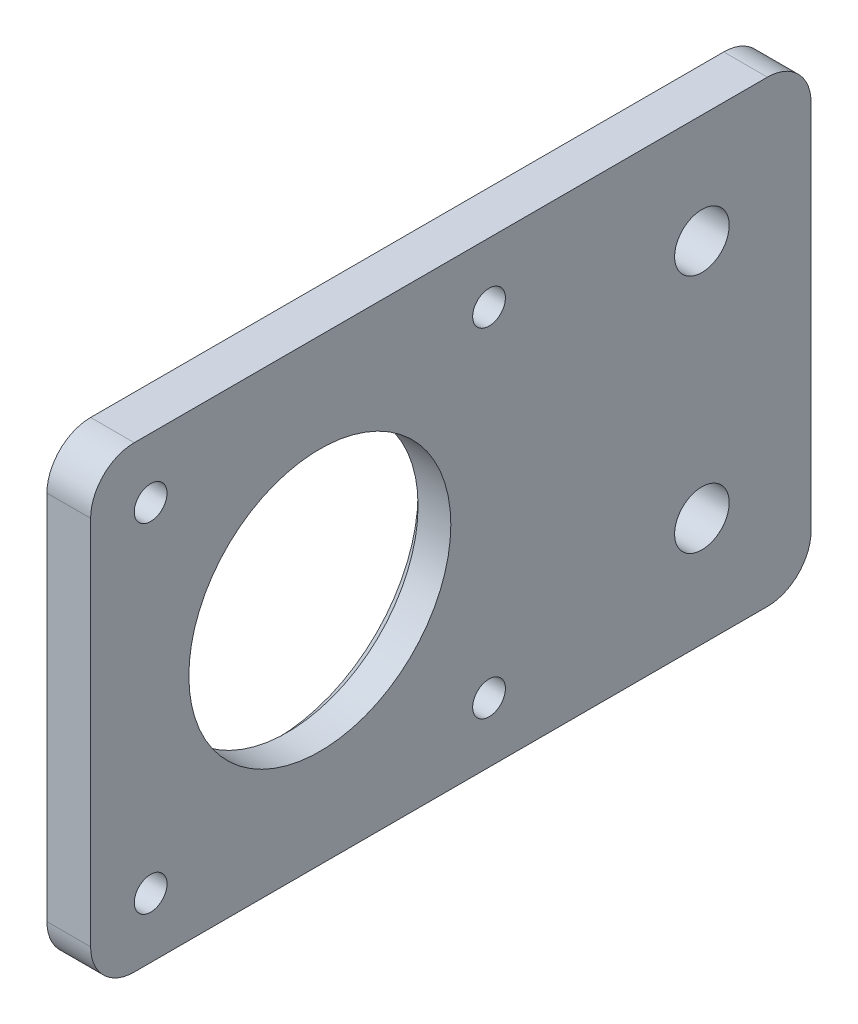
ISO-10303-21;
HEADER;
FILE_DESCRIPTION(('STEP AP214'),'2;1');
FILE_NAME('part.step','',(''),(''),'','','');
FILE_SCHEMA(('AUTOMOTIVE_DESIGN { 1 0 10303 214 1 1 1 1 }'));
ENDSEC;
DATA;
#1=APPLICATION_CONTEXT('core data for automotive mechanical design processes');
#2=APPLICATION_PROTOCOL_DEFINITION('international standard','automotive_design',2000,#1);
#3=PRODUCT_CONTEXT('',#1,'mechanical');
#4=PRODUCT('Part','Part','',(#3));
#5=PRODUCT_RELATED_PRODUCT_CATEGORY('part','',(#4));
#6=PRODUCT_DEFINITION_FORMATION('','',#4);
#7=PRODUCT_DEFINITION_CONTEXT('part definition',#1,'design');
#8=PRODUCT_DEFINITION('design','',#6,#7);
#9=PRODUCT_DEFINITION_SHAPE('','',#8);
#10=(LENGTH_UNIT() NAMED_UNIT(*) SI_UNIT(.MILLI.,.METRE.));
#11=(NAMED_UNIT(*) PLANE_ANGLE_UNIT() SI_UNIT($,.RADIAN.));
#12=(NAMED_UNIT(*) SI_UNIT($,.STERADIAN.) SOLID_ANGLE_UNIT());
#13=UNCERTAINTY_MEASURE_WITH_UNIT(LENGTH_MEASURE(1.E-05),#10,'distance_accuracy_value','');
#14=(GEOMETRIC_REPRESENTATION_CONTEXT(3) GLOBAL_UNCERTAINTY_ASSIGNED_CONTEXT((#13)) GLOBAL_UNIT_ASSIGNED_CONTEXT((#10,
#11,#12)) REPRESENTATION_CONTEXT('',''));
#15=CARTESIAN_POINT('',(0.,0.,0.));
#16=DIRECTION('',(0.,0.,1.));
#17=DIRECTION('',(1.,0.,0.));
#18=AXIS2_PLACEMENT_3D('',#15,#16,#17);
#19=CARTESIAN_POINT('',(4.,42.,-46.));
#20=DIRECTION('',(-1.,0.,0.));
#21=DIRECTION('',(0.,0.,1.));
#22=AXIS2_PLACEMENT_3D('',#19,#20,#21);
#23=PLANE('',#22);
#24=CARTESIAN_POINT('',(4.,32.,-56.));
#25=DIRECTION('',(-1.,0.,0.));
#26=DIRECTION('',(0.,0.,1.));
#27=AXIS2_PLACEMENT_3D('',#24,#25,#26);
#28=CIRCLE('',#27,2.5);
#29=CARTESIAN_POINT('',(4.,32.,-53.5));
#30=VERTEX_POINT('',#29);
#31=EDGE_CURVE('E160',#30,#30,#28,.T.);
#32=ORIENTED_EDGE('',*,*,#31,.T.);
#33=EDGE_LOOP('',(#32));
#34=FACE_BOUND('',#33,.T.);
#35=CARTESIAN_POINT('',(4.,10.,-56.));
#36=DIRECTION('',(-1.,0.,0.));
#37=DIRECTION('',(0.,0.,1.));
#38=AXIS2_PLACEMENT_3D('',#35,#36,#37);
#39=CIRCLE('',#38,2.5);
#40=CARTESIAN_POINT('',(4.,10.,-53.5));
#41=VERTEX_POINT('',#40);
#42=EDGE_CURVE('E272',#41,#41,#39,.T.);
#43=ORIENTED_EDGE('',*,*,#42,.T.);
#44=EDGE_LOOP('',(#43));
#45=FACE_BOUND('',#44,.T.);
#46=CARTESIAN_POINT('',(4.,5.5,-36.5));
#47=DIRECTION('',(-1.,0.,0.));
#48=DIRECTION('',(0.,0.,1.));
#49=AXIS2_PLACEMENT_3D('',#46,#47,#48);
#50=CIRCLE('',#49,1.5);
#51=CARTESIAN_POINT('',(4.,5.5,-35.));
#52=VERTEX_POINT('',#51);
#53=EDGE_CURVE('E266',#52,#52,#50,.T.);
#54=ORIENTED_EDGE('',*,*,#53,.T.);
#55=EDGE_LOOP('',(#54));
#56=FACE_BOUND('',#55,.T.);
#57=CARTESIAN_POINT('',(4.,36.5,-5.5));
#58=DIRECTION('',(-1.,0.,0.));
#59=DIRECTION('',(0.,0.,1.));
#60=AXIS2_PLACEMENT_3D('',#57,#58,#59);
#61=CIRCLE('',#60,1.5);
#62=CARTESIAN_POINT('',(4.,36.5,-4.));
#63=VERTEX_POINT('',#62);
#64=EDGE_CURVE('E255',#63,#63,#61,.T.);
#65=ORIENTED_EDGE('',*,*,#64,.T.);
#66=EDGE_LOOP('',(#65));
#67=FACE_BOUND('',#66,.T.);
#68=CARTESIAN_POINT('',(4.,21.,-21.));
#69=DIRECTION('',(-1.,0.,0.));
#70=DIRECTION('',(0.,0.,1.));
#71=AXIS2_PLACEMENT_3D('',#68,#69,#70);
#72=CIRCLE('',#71,12.);
#73=CARTESIAN_POINT('',(4.,21.,-9.));
#74=VERTEX_POINT('',#73);
#75=EDGE_CURVE('E173',#74,#74,#72,.T.);
#76=ORIENTED_EDGE('',*,*,#75,.T.);
#77=EDGE_LOOP('',(#76));
#78=FACE_BOUND('',#77,.T.);
#79=DIRECTION('',(0.,0.,-1.));
#80=VECTOR('',#79,1.);
#81=CARTESIAN_POINT('',(4.,0.,-46.));
#82=LINE('',#81,#80);
#83=CARTESIAN_POINT('',(4.,0.,-4.));
#84=VERTEX_POINT('',#83);
#85=CARTESIAN_POINT('',(4.,0.,-62.));
#86=VERTEX_POINT('',#85);
#87=EDGE_CURVE('E120',#84,#86,#82,.T.);
#88=ORIENTED_EDGE('',*,*,#87,.T.);
#89=CARTESIAN_POINT('',(4.,4.,-62.));
#90=DIRECTION('',(-1.,0.,0.));
#91=DIRECTION('',(0.,0.,1.));
#92=AXIS2_PLACEMENT_3D('',#89,#90,#91);
#93=CIRCLE('',#92,4.);
#94=CARTESIAN_POINT('',(4.,4.00000000000001,-66.));
#95=VERTEX_POINT('',#94);
#96=EDGE_CURVE('E145',#86,#95,#93,.F.);
#97=ORIENTED_EDGE('',*,*,#96,.T.);
#98=DIRECTION('',(0.,-1.,0.));
#99=VECTOR('',#98,1.);
#100=CARTESIAN_POINT('',(4.,42.,-66.));
#101=LINE('',#100,#99);
#102=CARTESIAN_POINT('',(4.,38.,-66.));
#103=VERTEX_POINT('',#102);
#104=EDGE_CURVE('E159',#103,#95,#101,.T.);
#105=ORIENTED_EDGE('',*,*,#104,.F.);
#106=CARTESIAN_POINT('',(4.,38.,-62.));
#107=DIRECTION('',(-1.,0.,0.));
#108=DIRECTION('',(0.,0.,1.));
#109=AXIS2_PLACEMENT_3D('',#106,#107,#108);
#110=CIRCLE('',#109,4.);
#111=CARTESIAN_POINT('',(4.,42.,-62.));
#112=VERTEX_POINT('',#111);
#113=EDGE_CURVE('E138',#103,#112,#110,.F.);
#114=ORIENTED_EDGE('',*,*,#113,.T.);
#115=DIRECTION('',(0.,0.,-1.));
#116=VECTOR('',#115,1.);
#117=CARTESIAN_POINT('',(4.,42.,-46.));
#118=LINE('',#117,#116);
#119=CARTESIAN_POINT('',(4.,42.,-4.));
#120=VERTEX_POINT('',#119);
#121=EDGE_CURVE('E119',#120,#112,#118,.T.);
#122=ORIENTED_EDGE('',*,*,#121,.F.);
#123=CARTESIAN_POINT('',(4.,38.,-4.));
#124=DIRECTION('',(-1.,0.,0.));
#125=DIRECTION('',(0.,0.,1.));
#126=AXIS2_PLACEMENT_3D('',#123,#124,#125);
#127=CIRCLE('',#126,4.);
#128=CARTESIAN_POINT('',(4.,38.,0.));
#129=VERTEX_POINT('',#128);
#130=EDGE_CURVE('E128',#120,#129,#127,.F.);
#131=ORIENTED_EDGE('',*,*,#130,.T.);
#132=DIRECTION('',(0.,-1.,0.));
#133=VECTOR('',#132,1.);
#134=CARTESIAN_POINT('',(4.,42.,0.));
#135=LINE('',#134,#133);
#136=CARTESIAN_POINT('',(4.,4.00000000000001,0.));
#137=VERTEX_POINT('',#136);
#138=EDGE_CURVE('E178',#129,#137,#135,.T.);
#139=ORIENTED_EDGE('',*,*,#138,.T.);
#140=CARTESIAN_POINT('',(4.,4.,-4.));
#141=DIRECTION('',(-1.,0.,0.));
#142=DIRECTION('',(0.,0.,1.));
#143=AXIS2_PLACEMENT_3D('',#140,#141,#142);
#144=CIRCLE('',#143,4.);
#145=EDGE_CURVE('E187',#137,#84,#144,.F.);
#146=ORIENTED_EDGE('',*,*,#145,.T.);
#147=EDGE_LOOP('',(#88,#97,#105,#114,#122,#131,#139,#146));
#148=FACE_BOUND('',#147,.T.);
#149=CARTESIAN_POINT('',(4.,36.5,-36.5));
#150=DIRECTION('',(-1.,0.,0.));
#151=DIRECTION('',(0.,0.,1.));
#152=AXIS2_PLACEMENT_3D('',#149,#150,#151);
#153=CIRCLE('',#152,1.5);
#154=CARTESIAN_POINT('',(4.,36.5,-35.));
#155=VERTEX_POINT('',#154);
#156=EDGE_CURVE('E245',#155,#155,#153,.F.);
#157=ORIENTED_EDGE('',*,*,#156,.F.);
#158=EDGE_LOOP('',(#157));
#159=FACE_BOUND('',#158,.T.);
#160=CARTESIAN_POINT('',(4.,5.5,-5.5));
#161=DIRECTION('',(-1.,0.,0.));
#162=DIRECTION('',(0.,0.,1.));
#163=AXIS2_PLACEMENT_3D('',#160,#161,#162);
#164=CIRCLE('',#163,1.5);
#165=CARTESIAN_POINT('',(4.,5.5,-4.));
#166=VERTEX_POINT('',#165);
#167=EDGE_CURVE('E261',#166,#166,#164,.F.);
#168=ORIENTED_EDGE('',*,*,#167,.F.);
#169=EDGE_LOOP('',(#168));
#170=FACE_BOUND('',#169,.T.);
#171=ADVANCED_FACE('F42',(#34,#45,#56,#67,#78,#148,#159,#170),#23,.F.);
#172=CARTESIAN_POINT('',(0.,42.,0.));
#173=DIRECTION('',(1.,0.,0.));
#174=DIRECTION('',(0.,0.,-1.));
#175=AXIS2_PLACEMENT_3D('',#172,#173,#174);
#176=PLANE('',#175);
#177=CARTESIAN_POINT('',(0.,32.,-56.));
#178=DIRECTION('',(-1.,0.,0.));
#179=DIRECTION('',(0.,0.,1.));
#180=AXIS2_PLACEMENT_3D('',#177,#178,#179);
#181=CIRCLE('',#180,2.5);
#182=CARTESIAN_POINT('',(0.,32.,-53.5));
#183=VERTEX_POINT('',#182);
#184=EDGE_CURVE('E275',#183,#183,#181,.T.);
#185=ORIENTED_EDGE('',*,*,#184,.F.);
#186=EDGE_LOOP('',(#185));
#187=FACE_BOUND('',#186,.T.);
#188=CARTESIAN_POINT('',(0.,10.,-56.));
#189=DIRECTION('',(-1.,0.,0.));
#190=DIRECTION('',(0.,0.,-1.));
#191=AXIS2_PLACEMENT_3D('',#188,#189,#190);
#192=CIRCLE('',#191,2.5);
#193=CARTESIAN_POINT('',(0.,10.,-58.5));
#194=VERTEX_POINT('',#193);
#195=EDGE_CURVE('E276',#194,#194,#192,.T.);
#196=ORIENTED_EDGE('',*,*,#195,.F.);
#197=EDGE_LOOP('',(#196));
#198=FACE_BOUND('',#197,.T.);
#199=CARTESIAN_POINT('',(0.,21.,-21.));
#200=DIRECTION('',(1.,0.,0.));
#201=DIRECTION('',(0.,0.,-1.));
#202=AXIS2_PLACEMENT_3D('',#199,#200,#201);
#203=CIRCLE('',#202,13.);
#204=CARTESIAN_POINT('',(0.,21.,-34.));
#205=VERTEX_POINT('',#204);
#206=EDGE_CURVE('E129',#205,#205,#203,.T.);
#207=ORIENTED_EDGE('',*,*,#206,.T.);
#208=EDGE_LOOP('',(#207));
#209=FACE_BOUND('',#208,.T.);
#210=CARTESIAN_POINT('',(0.,5.5,-36.5));
#211=DIRECTION('',(-1.,0.,0.));
#212=DIRECTION('',(0.,0.,1.));
#213=AXIS2_PLACEMENT_3D('',#210,#211,#212);
#214=CIRCLE('',#213,1.5);
#215=CARTESIAN_POINT('',(0.,5.5,-35.));
#216=VERTEX_POINT('',#215);
#217=EDGE_CURVE('E264',#216,#216,#214,.T.);
#218=ORIENTED_EDGE('',*,*,#217,.F.);
#219=EDGE_LOOP('',(#218));
#220=FACE_BOUND('',#219,.T.);
#221=CARTESIAN_POINT('',(0.,36.5,-5.5));
#222=DIRECTION('',(-1.,0.,0.));
#223=DIRECTION('',(0.,0.,1.));
#224=AXIS2_PLACEMENT_3D('',#221,#222,#223);
#225=CIRCLE('',#224,1.5);
#226=CARTESIAN_POINT('',(0.,36.5,-4.));
#227=VERTEX_POINT('',#226);
#228=EDGE_CURVE('E249',#227,#227,#225,.T.);
#229=ORIENTED_EDGE('',*,*,#228,.F.);
#230=EDGE_LOOP('',(#229));
#231=FACE_BOUND('',#230,.T.);
#232=DIRECTION('',(0.,-1.,0.));
#233=VECTOR('',#232,1.);
#234=CARTESIAN_POINT('',(0.,42.,-66.));
#235=LINE('',#234,#233);
#236=CARTESIAN_POINT('',(0.,38.,-66.));
#237=VERTEX_POINT('',#236);
#238=CARTESIAN_POINT('',(0.,4.00000000000001,-66.));
#239=VERTEX_POINT('',#238);
#240=EDGE_CURVE('E153',#237,#239,#235,.T.);
#241=ORIENTED_EDGE('',*,*,#240,.T.);
#242=CARTESIAN_POINT('',(0.,4.,-62.));
#243=DIRECTION('',(1.,0.,0.));
#244=DIRECTION('',(0.,0.,-1.));
#245=AXIS2_PLACEMENT_3D('',#242,#243,#244);
#246=CIRCLE('',#245,4.);
#247=CARTESIAN_POINT('',(0.,0.,-62.));
#248=VERTEX_POINT('',#247);
#249=EDGE_CURVE('E50',#239,#248,#246,.F.);
#250=ORIENTED_EDGE('',*,*,#249,.T.);
#251=DIRECTION('',(0.,0.,1.));
#252=VECTOR('',#251,1.);
#253=CARTESIAN_POINT('',(0.,0.,0.));
#254=LINE('',#253,#252);
#255=CARTESIAN_POINT('',(0.,0.,-4.));
#256=VERTEX_POINT('',#255);
#257=EDGE_CURVE('E107',#248,#256,#254,.T.);
#258=ORIENTED_EDGE('',*,*,#257,.T.);
#259=CARTESIAN_POINT('',(0.,4.,-4.));
#260=DIRECTION('',(1.,0.,0.));
#261=DIRECTION('',(0.,0.,-1.));
#262=AXIS2_PLACEMENT_3D('',#259,#260,#261);
#263=CIRCLE('',#262,4.);
#264=CARTESIAN_POINT('',(0.,4.00000000000001,0.));
#265=VERTEX_POINT('',#264);
#266=EDGE_CURVE('E113',#256,#265,#263,.F.);
#267=ORIENTED_EDGE('',*,*,#266,.T.);
#268=DIRECTION('',(0.,-1.,0.));
#269=VECTOR('',#268,1.);
#270=CARTESIAN_POINT('',(0.,42.,0.));
#271=LINE('',#270,#269);
#272=CARTESIAN_POINT('',(0.,38.,0.));
#273=VERTEX_POINT('',#272);
#274=EDGE_CURVE('E170',#273,#265,#271,.T.);
#275=ORIENTED_EDGE('',*,*,#274,.F.);
#276=CARTESIAN_POINT('',(0.,38.,-4.));
#277=DIRECTION('',(1.,0.,0.));
#278=DIRECTION('',(0.,0.,-1.));
#279=AXIS2_PLACEMENT_3D('',#276,#277,#278);
#280=CIRCLE('',#279,4.);
#281=CARTESIAN_POINT('',(0.,42.,-4.));
#282=VERTEX_POINT('',#281);
#283=EDGE_CURVE('E136',#273,#282,#280,.F.);
#284=ORIENTED_EDGE('',*,*,#283,.T.);
#285=DIRECTION('',(0.,0.,1.));
#286=VECTOR('',#285,1.);
#287=CARTESIAN_POINT('',(0.,42.,0.));
#288=LINE('',#287,#286);
#289=CARTESIAN_POINT('',(0.,42.,-62.));
#290=VERTEX_POINT('',#289);
#291=EDGE_CURVE('E154',#290,#282,#288,.T.);
#292=ORIENTED_EDGE('',*,*,#291,.F.);
#293=CARTESIAN_POINT('',(0.,38.,-62.));
#294=DIRECTION('',(1.,0.,0.));
#295=DIRECTION('',(0.,0.,-1.));
#296=AXIS2_PLACEMENT_3D('',#293,#294,#295);
#297=CIRCLE('',#296,4.);
#298=EDGE_CURVE('E151',#290,#237,#297,.F.);
#299=ORIENTED_EDGE('',*,*,#298,.T.);
#300=EDGE_LOOP('',(#241,#250,#258,#267,#275,#284,#292,#299));
#301=FACE_BOUND('',#300,.T.);
#302=CARTESIAN_POINT('',(0.,36.5,-36.5));
#303=DIRECTION('',(-1.,0.,0.));
#304=DIRECTION('',(0.,0.,1.));
#305=AXIS2_PLACEMENT_3D('',#302,#303,#304);
#306=CIRCLE('',#305,1.5);
#307=CARTESIAN_POINT('',(0.,36.5,-35.));
#308=VERTEX_POINT('',#307);
#309=EDGE_CURVE('E243',#308,#308,#306,.F.);
#310=ORIENTED_EDGE('',*,*,#309,.T.);
#311=EDGE_LOOP('',(#310));
#312=FACE_BOUND('',#311,.T.);
#313=CARTESIAN_POINT('',(0.,5.5,-5.5));
#314=DIRECTION('',(-1.,0.,0.));
#315=DIRECTION('',(0.,0.,1.));
#316=AXIS2_PLACEMENT_3D('',#313,#314,#315);
#317=CIRCLE('',#316,1.5);
#318=CARTESIAN_POINT('',(0.,5.5,-4.));
#319=VERTEX_POINT('',#318);
#320=EDGE_CURVE('E258',#319,#319,#317,.F.);
#321=ORIENTED_EDGE('',*,*,#320,.T.);
#322=EDGE_LOOP('',(#321));
#323=FACE_BOUND('',#322,.T.);
#324=ADVANCED_FACE('F109',(#187,#198,#209,#220,#231,#301,#312,#323),#176,.F.);
#325=CARTESIAN_POINT('',(4.,42.,0.));
#326=DIRECTION('',(0.,0.,-1.));
#327=DIRECTION('',(-1.,0.,0.));
#328=AXIS2_PLACEMENT_3D('',#325,#326,#327);
#329=PLANE('',#328);
#330=ORIENTED_EDGE('',*,*,#274,.T.);
#331=DIRECTION('',(1.,0.,0.));
#332=VECTOR('',#331,1.);
#333=CARTESIAN_POINT('',(4.,4.,0.));
#334=LINE('',#333,#332);
#335=EDGE_CURVE('E134',#265,#137,#334,.T.);
#336=ORIENTED_EDGE('',*,*,#335,.T.);
#337=ORIENTED_EDGE('',*,*,#138,.F.);
#338=DIRECTION('',(1.,0.,0.));
#339=VECTOR('',#338,1.);
#340=CARTESIAN_POINT('',(4.,38.,0.));
#341=LINE('',#340,#339);
#342=EDGE_CURVE('E190',#129,#273,#341,.F.);
#343=ORIENTED_EDGE('',*,*,#342,.T.);
#344=EDGE_LOOP('',(#330,#336,#337,#343));
#345=FACE_BOUND('',#344,.T.);
#346=ADVANCED_FACE('F193',(#345),#329,.F.);
#347=CARTESIAN_POINT('',(0.,42.,0.));
#348=DIRECTION('',(0.,-1.,0.));
#349=DIRECTION('',(0.,0.,-1.));
#350=AXIS2_PLACEMENT_3D('',#347,#348,#349);
#351=PLANE('',#350);
#352=ORIENTED_EDGE('',*,*,#121,.T.);
#353=DIRECTION('',(1.,0.,0.));
#354=VECTOR('',#353,1.);
#355=CARTESIAN_POINT('',(0.,42.,-62.));
#356=LINE('',#355,#354);
#357=EDGE_CURVE('E12',#112,#290,#356,.F.);
#358=ORIENTED_EDGE('',*,*,#357,.T.);
#359=ORIENTED_EDGE('',*,*,#291,.T.);
#360=DIRECTION('',(1.,0.,0.));
#361=VECTOR('',#360,1.);
#362=CARTESIAN_POINT('',(0.,42.,-4.));
#363=LINE('',#362,#361);
#364=EDGE_CURVE('E168',#282,#120,#363,.T.);
#365=ORIENTED_EDGE('',*,*,#364,.T.);
#366=EDGE_LOOP('',(#352,#358,#359,#365));
#367=FACE_BOUND('',#366,.T.);
#368=ADVANCED_FACE('F166',(#367),#351,.F.);
#369=CARTESIAN_POINT('',(0.,0.,0.));
#370=DIRECTION('',(0.,-1.,0.));
#371=DIRECTION('',(0.,0.,-1.));
#372=AXIS2_PLACEMENT_3D('',#369,#370,#371);
#373=PLANE('',#372);
#374=ORIENTED_EDGE('',*,*,#257,.F.);
#375=DIRECTION('',(1.,0.,0.));
#376=VECTOR('',#375,1.);
#377=CARTESIAN_POINT('',(0.,0.,-62.));
#378=LINE('',#377,#376);
#379=EDGE_CURVE('E135',#248,#86,#378,.T.);
#380=ORIENTED_EDGE('',*,*,#379,.T.);
#381=ORIENTED_EDGE('',*,*,#87,.F.);
#382=DIRECTION('',(1.,0.,0.));
#383=VECTOR('',#382,1.);
#384=CARTESIAN_POINT('',(0.,0.,-4.));
#385=LINE('',#384,#383);
#386=EDGE_CURVE('E124',#84,#256,#385,.F.);
#387=ORIENTED_EDGE('',*,*,#386,.T.);
#388=EDGE_LOOP('',(#374,#380,#381,#387));
#389=FACE_BOUND('',#388,.T.);
#390=ADVANCED_FACE('F125',(#389),#373,.T.);
#391=CARTESIAN_POINT('',(4.,21.,-21.));
#392=DIRECTION('',(-1.,0.,0.));
#393=DIRECTION('',(0.,0.,1.));
#394=AXIS2_PLACEMENT_3D('',#391,#392,#393);
#395=CYLINDRICAL_SURFACE('',#394,12.);
#396=CARTESIAN_POINT('',(1.00000000000001,21.,-21.));
#397=DIRECTION('',(1.,0.,0.));
#398=DIRECTION('',(0.,0.,-1.));
#399=AXIS2_PLACEMENT_3D('',#396,#397,#398);
#400=CIRCLE('',#399,12.);
#401=CARTESIAN_POINT('',(1.00000000000001,21.,-33.));
#402=VERTEX_POINT('',#401);
#403=EDGE_CURVE('E181',#402,#402,#400,.F.);
#404=ORIENTED_EDGE('',*,*,#403,.T.);
#405=EDGE_LOOP('',(#404));
#406=FACE_BOUND('',#405,.T.);
#407=ORIENTED_EDGE('',*,*,#75,.F.);
#408=EDGE_LOOP('',(#407));
#409=FACE_BOUND('',#408,.T.);
#410=ADVANCED_FACE('F235',(#406,#409),#395,.F.);
#411=CARTESIAN_POINT('',(4.,36.5,-36.5));
#412=DIRECTION('',(-1.,0.,0.));
#413=DIRECTION('',(0.,0.,1.));
#414=AXIS2_PLACEMENT_3D('',#411,#412,#413);
#415=CYLINDRICAL_SURFACE('',#414,1.5);
#416=ORIENTED_EDGE('',*,*,#156,.T.);
#417=EDGE_LOOP('',(#416));
#418=FACE_BOUND('',#417,.T.);
#419=ORIENTED_EDGE('',*,*,#309,.F.);
#420=EDGE_LOOP('',(#419));
#421=FACE_BOUND('',#420,.T.);
#422=ADVANCED_FACE('F238',(#418,#421),#415,.F.);
#423=CARTESIAN_POINT('',(4.,36.5,-5.5));
#424=DIRECTION('',(-1.,0.,0.));
#425=DIRECTION('',(0.,0.,1.));
#426=AXIS2_PLACEMENT_3D('',#423,#424,#425);
#427=CYLINDRICAL_SURFACE('',#426,1.5);
#428=ORIENTED_EDGE('',*,*,#64,.F.);
#429=EDGE_LOOP('',(#428));
#430=FACE_BOUND('',#429,.T.);
#431=ORIENTED_EDGE('',*,*,#228,.T.);
#432=EDGE_LOOP('',(#431));
#433=FACE_BOUND('',#432,.T.);
#434=ADVANCED_FACE('F292',(#430,#433),#427,.F.);
#435=CARTESIAN_POINT('',(4.,5.5,-5.5));
#436=DIRECTION('',(-1.,0.,0.));
#437=DIRECTION('',(0.,0.,1.));
#438=AXIS2_PLACEMENT_3D('',#435,#436,#437);
#439=CYLINDRICAL_SURFACE('',#438,1.5);
#440=ORIENTED_EDGE('',*,*,#167,.T.);
#441=EDGE_LOOP('',(#440));
#442=FACE_BOUND('',#441,.T.);
#443=ORIENTED_EDGE('',*,*,#320,.F.);
#444=EDGE_LOOP('',(#443));
#445=FACE_BOUND('',#444,.T.);
#446=ADVANCED_FACE('F228',(#442,#445),#439,.F.);
#447=CARTESIAN_POINT('',(4.,5.5,-36.5));
#448=DIRECTION('',(-1.,0.,0.));
#449=DIRECTION('',(0.,0.,1.));
#450=AXIS2_PLACEMENT_3D('',#447,#448,#449);
#451=CYLINDRICAL_SURFACE('',#450,1.5);
#452=ORIENTED_EDGE('',*,*,#53,.F.);
#453=EDGE_LOOP('',(#452));
#454=FACE_BOUND('',#453,.T.);
#455=ORIENTED_EDGE('',*,*,#217,.T.);
#456=EDGE_LOOP('',(#455));
#457=FACE_BOUND('',#456,.T.);
#458=ADVANCED_FACE('F223',(#454,#457),#451,.F.);
#459=CARTESIAN_POINT('',(1.00000000000001,21.,-21.));
#460=DIRECTION('',(-1.,0.,0.));
#461=DIRECTION('',(0.,0.,1.));
#462=AXIS2_PLACEMENT_3D('',#459,#460,#461);
#463=CONICAL_SURFACE('',#462,12.,0.785398163397447);
#464=ORIENTED_EDGE('',*,*,#206,.F.);
#465=EDGE_LOOP('',(#464));
#466=FACE_BOUND('',#465,.T.);
#467=ORIENTED_EDGE('',*,*,#403,.F.);
#468=EDGE_LOOP('',(#467));
#469=FACE_BOUND('',#468,.T.);
#470=ADVANCED_FACE('F206',(#466,#469),#463,.F.);
#471=CARTESIAN_POINT('',(4.,4.,-4.));
#472=DIRECTION('',(-1.,0.,0.));
#473=DIRECTION('',(0.,0.,1.));
#474=AXIS2_PLACEMENT_3D('',#471,#472,#473);
#475=CYLINDRICAL_SURFACE('',#474,4.);
#476=ORIENTED_EDGE('',*,*,#266,.F.);
#477=ORIENTED_EDGE('',*,*,#386,.F.);
#478=ORIENTED_EDGE('',*,*,#145,.F.);
#479=ORIENTED_EDGE('',*,*,#335,.F.);
#480=EDGE_LOOP('',(#476,#477,#478,#479));
#481=FACE_BOUND('',#480,.T.);
#482=ADVANCED_FACE('F132',(#481),#475,.T.);
#483=CARTESIAN_POINT('',(0.,38.,-4.));
#484=DIRECTION('',(1.,0.,0.));
#485=DIRECTION('',(0.,0.,-1.));
#486=AXIS2_PLACEMENT_3D('',#483,#484,#485);
#487=CYLINDRICAL_SURFACE('',#486,4.);
#488=ORIENTED_EDGE('',*,*,#283,.F.);
#489=ORIENTED_EDGE('',*,*,#342,.F.);
#490=ORIENTED_EDGE('',*,*,#130,.F.);
#491=ORIENTED_EDGE('',*,*,#364,.F.);
#492=EDGE_LOOP('',(#488,#489,#490,#491));
#493=FACE_BOUND('',#492,.T.);
#494=ADVANCED_FACE('F197',(#493),#487,.T.);
#495=CARTESIAN_POINT('',(0.,42.,-66.));
#496=DIRECTION('',(0.,0.,-1.));
#497=DIRECTION('',(-1.,0.,0.));
#498=AXIS2_PLACEMENT_3D('',#495,#496,#497);
#499=PLANE('',#498);
#500=ORIENTED_EDGE('',*,*,#104,.T.);
#501=DIRECTION('',(1.,0.,0.));
#502=VECTOR('',#501,1.);
#503=CARTESIAN_POINT('',(0.,4.,-66.));
#504=LINE('',#503,#502);
#505=EDGE_CURVE('E63',#95,#239,#504,.F.);
#506=ORIENTED_EDGE('',*,*,#505,.T.);
#507=ORIENTED_EDGE('',*,*,#240,.F.);
#508=DIRECTION('',(1.,0.,0.));
#509=VECTOR('',#508,1.);
#510=CARTESIAN_POINT('',(4.,38.,-66.));
#511=LINE('',#510,#509);
#512=EDGE_CURVE('E147',#237,#103,#511,.T.);
#513=ORIENTED_EDGE('',*,*,#512,.T.);
#514=EDGE_LOOP('',(#500,#506,#507,#513));
#515=FACE_BOUND('',#514,.T.);
#516=ADVANCED_FACE('F157',(#515),#499,.T.);
#517=CARTESIAN_POINT('',(44.,10.,-56.));
#518=DIRECTION('',(-1.,0.,0.));
#519=DIRECTION('',(0.,0.,1.));
#520=AXIS2_PLACEMENT_3D('',#517,#518,#519);
#521=CYLINDRICAL_SURFACE('',#520,2.5);
#522=ORIENTED_EDGE('',*,*,#195,.T.);
#523=EDGE_LOOP('',(#522));
#524=FACE_BOUND('',#523,.T.);
#525=ORIENTED_EDGE('',*,*,#42,.F.);
#526=EDGE_LOOP('',(#525));
#527=FACE_BOUND('',#526,.T.);
#528=ADVANCED_FACE('F204',(#524,#527),#521,.F.);
#529=CARTESIAN_POINT('',(44.,32.,-56.));
#530=DIRECTION('',(-1.,0.,0.));
#531=DIRECTION('',(0.,0.,1.));
#532=AXIS2_PLACEMENT_3D('',#529,#530,#531);
#533=CYLINDRICAL_SURFACE('',#532,2.5);
#534=ORIENTED_EDGE('',*,*,#184,.T.);
#535=EDGE_LOOP('',(#534));
#536=FACE_BOUND('',#535,.T.);
#537=ORIENTED_EDGE('',*,*,#31,.F.);
#538=EDGE_LOOP('',(#537));
#539=FACE_BOUND('',#538,.T.);
#540=ADVANCED_FACE('F282',(#536,#539),#533,.F.);
#541=CARTESIAN_POINT('',(0.,4.,-62.));
#542=DIRECTION('',(1.,0.,0.));
#543=DIRECTION('',(0.,0.,-1.));
#544=AXIS2_PLACEMENT_3D('',#541,#542,#543);
#545=CYLINDRICAL_SURFACE('',#544,4.);
#546=ORIENTED_EDGE('',*,*,#249,.F.);
#547=ORIENTED_EDGE('',*,*,#505,.F.);
#548=ORIENTED_EDGE('',*,*,#96,.F.);
#549=ORIENTED_EDGE('',*,*,#379,.F.);
#550=EDGE_LOOP('',(#546,#547,#548,#549));
#551=FACE_BOUND('',#550,.T.);
#552=ADVANCED_FACE('F408',(#551),#545,.T.);
#553=CARTESIAN_POINT('',(0.,38.,-62.));
#554=DIRECTION('',(-1.,0.,0.));
#555=DIRECTION('',(0.,0.,1.));
#556=AXIS2_PLACEMENT_3D('',#553,#554,#555);
#557=CYLINDRICAL_SURFACE('',#556,4.);
#558=ORIENTED_EDGE('',*,*,#298,.F.);
#559=ORIENTED_EDGE('',*,*,#357,.F.);
#560=ORIENTED_EDGE('',*,*,#113,.F.);
#561=ORIENTED_EDGE('',*,*,#512,.F.);
#562=EDGE_LOOP('',(#558,#559,#560,#561));
#563=FACE_BOUND('',#562,.T.);
#564=ADVANCED_FACE('F44',(#563),#557,.T.);
#565=CLOSED_SHELL('',(#171,#324,#346,#368,#390,#410,#422,#434,#446,#458,#470,#482,#494,#516,
#528,#540,#552,#564));
#566=MANIFOLD_SOLID_BREP('B2',#565);
#567=ADVANCED_BREP_SHAPE_REPRESENTATION('',(#18,#566),#14);
#568=SHAPE_DEFINITION_REPRESENTATION(#9,#567);
ENDSEC;
END-ISO-10303-21;
